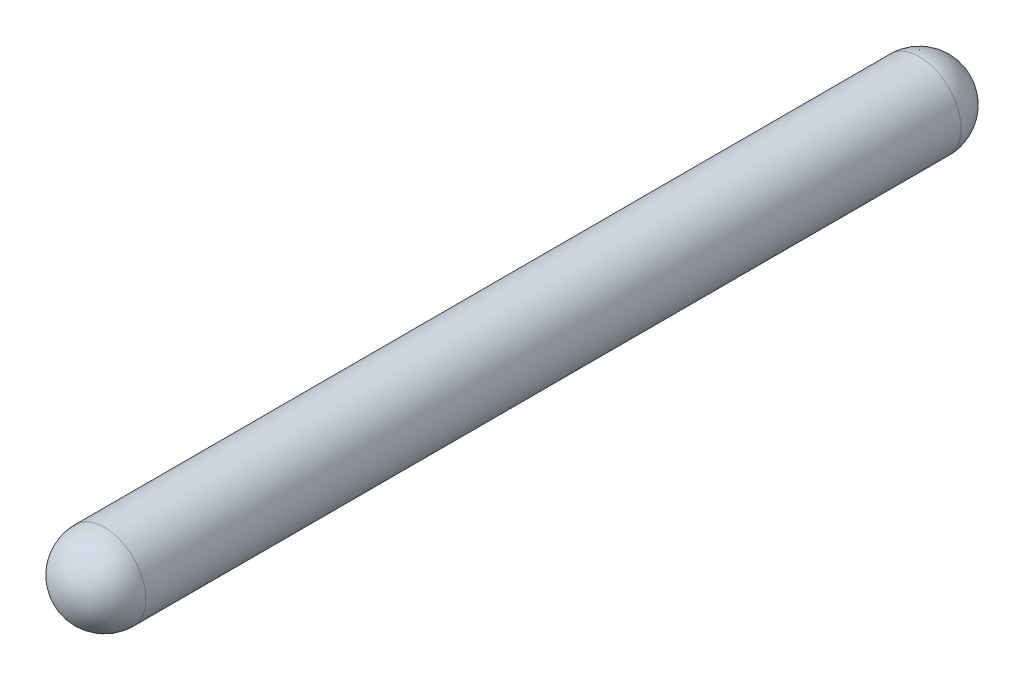
ISO-10303-21;
HEADER;
FILE_DESCRIPTION(('STEP AP214'),'2;1');
FILE_NAME('part.step','',(''),(''),'','','');
FILE_SCHEMA(('AUTOMOTIVE_DESIGN { 1 0 10303 214 1 1 1 1 }'));
ENDSEC;
DATA;
#1=APPLICATION_CONTEXT('core data for automotive mechanical design processes');
#2=APPLICATION_PROTOCOL_DEFINITION('international standard','automotive_design',2000,#1);
#3=PRODUCT_CONTEXT('',#1,'mechanical');
#4=PRODUCT('Part','Part','',(#3));
#5=PRODUCT_RELATED_PRODUCT_CATEGORY('part','',(#4));
#6=PRODUCT_DEFINITION_FORMATION('','',#4);
#7=PRODUCT_DEFINITION_CONTEXT('part definition',#1,'design');
#8=PRODUCT_DEFINITION('design','',#6,#7);
#9=PRODUCT_DEFINITION_SHAPE('','',#8);
#10=(LENGTH_UNIT() NAMED_UNIT(*) SI_UNIT(.MILLI.,.METRE.));
#11=(NAMED_UNIT(*) PLANE_ANGLE_UNIT() SI_UNIT($,.RADIAN.));
#12=(NAMED_UNIT(*) SI_UNIT($,.STERADIAN.) SOLID_ANGLE_UNIT());
#13=UNCERTAINTY_MEASURE_WITH_UNIT(LENGTH_MEASURE(1.E-05),#10,'distance_accuracy_value','');
#14=(GEOMETRIC_REPRESENTATION_CONTEXT(3) GLOBAL_UNCERTAINTY_ASSIGNED_CONTEXT((#13)) GLOBAL_UNIT_ASSIGNED_CONTEXT((#10,
#11,#12)) REPRESENTATION_CONTEXT('',''));
#15=CARTESIAN_POINT('',(0.,0.,0.));
#16=DIRECTION('',(0.,0.,1.));
#17=DIRECTION('',(1.,0.,0.));
#18=AXIS2_PLACEMENT_3D('',#15,#16,#17);
#19=CARTESIAN_POINT('',(-0.936,-13.77,-3.));
#20=DIRECTION('',(1.,0.,0.));
#21=DIRECTION('',(0.,-1.,0.));
#22=AXIS2_PLACEMENT_3D('',#19,#20,#21);
#23=SPHERICAL_SURFACE('',#22,0.331);
#24=CARTESIAN_POINT('',(-0.936,-13.77,-3.));
#25=DIRECTION('',(0.,0.,1.));
#26=DIRECTION('',(1.,0.,0.));
#27=AXIS2_PLACEMENT_3D('',#24,#25,#26);
#28=CIRCLE('',#27,0.331);
#29=CARTESIAN_POINT('',(-0.605,-13.77,-3.));
#30=VERTEX_POINT('',#29);
#31=CARTESIAN_POINT('',(-1.267,-13.77,-3.));
#32=VERTEX_POINT('',#31);
#33=EDGE_CURVE('E42',#30,#32,#28,.T.);
#34=ORIENTED_EDGE('',*,*,#33,.F.);
#35=CARTESIAN_POINT('',(-0.936,-13.77,-3.));
#36=DIRECTION('',(0.,0.,1.));
#37=DIRECTION('',(1.,0.,0.));
#38=AXIS2_PLACEMENT_3D('',#35,#36,#37);
#39=CIRCLE('',#38,0.331);
#40=EDGE_CURVE('E26',#32,#30,#39,.T.);
#41=ORIENTED_EDGE('',*,*,#40,.F.);
#42=EDGE_LOOP('',(#34,#41));
#43=FACE_BOUND('',#42,.T.);
#44=ADVANCED_FACE('F17',(#43),#23,.T.);
#45=CARTESIAN_POINT('',(-0.936,-13.77,3.5));
#46=DIRECTION('',(1.,0.,0.));
#47=DIRECTION('',(0.,1.,0.));
#48=AXIS2_PLACEMENT_3D('',#45,#46,#47);
#49=SPHERICAL_SURFACE('',#48,0.331);
#50=CARTESIAN_POINT('',(-0.936,-13.77,3.5));
#51=DIRECTION('',(0.,0.,1.));
#52=DIRECTION('',(1.,0.,0.));
#53=AXIS2_PLACEMENT_3D('',#50,#51,#52);
#54=CIRCLE('',#53,0.331);
#55=CARTESIAN_POINT('',(-0.605,-13.77,3.5));
#56=VERTEX_POINT('',#55);
#57=CARTESIAN_POINT('',(-1.267,-13.77,3.5));
#58=VERTEX_POINT('',#57);
#59=EDGE_CURVE('E11',#56,#58,#54,.F.);
#60=ORIENTED_EDGE('',*,*,#59,.F.);
#61=CARTESIAN_POINT('',(-0.936,-13.77,3.5));
#62=DIRECTION('',(0.,0.,1.));
#63=DIRECTION('',(1.,0.,0.));
#64=AXIS2_PLACEMENT_3D('',#61,#62,#63);
#65=CIRCLE('',#64,0.331);
#66=EDGE_CURVE('E34',#58,#56,#65,.F.);
#67=ORIENTED_EDGE('',*,*,#66,.F.);
#68=EDGE_LOOP('',(#60,#67));
#69=FACE_BOUND('',#68,.T.);
#70=ADVANCED_FACE('F49',(#69),#49,.T.);
#71=CARTESIAN_POINT('',(-0.936,-13.77,-3.));
#72=DIRECTION('',(0.,0.,1.));
#73=DIRECTION('',(1.,0.,0.));
#74=AXIS2_PLACEMENT_3D('',#71,#72,#73);
#75=CYLINDRICAL_SURFACE('',#74,0.331);
#76=ORIENTED_EDGE('',*,*,#66,.T.);
#77=ORIENTED_EDGE('',*,*,#59,.T.);
#78=EDGE_LOOP('',(#76,#77));
#79=FACE_BOUND('',#78,.T.);
#80=ORIENTED_EDGE('',*,*,#40,.T.);
#81=ORIENTED_EDGE('',*,*,#33,.T.);
#82=EDGE_LOOP('',(#80,#81));
#83=FACE_BOUND('',#82,.T.);
#84=ADVANCED_FACE('F45',(#79,#83),#75,.T.);
#85=CLOSED_SHELL('',(#44,#70,#84));
#86=MANIFOLD_SOLID_BREP('B1',#85);
#87=ADVANCED_BREP_SHAPE_REPRESENTATION('',(#18,#86),#14);
#88=SHAPE_DEFINITION_REPRESENTATION(#9,#87);
ENDSEC;
END-ISO-10303-21;
